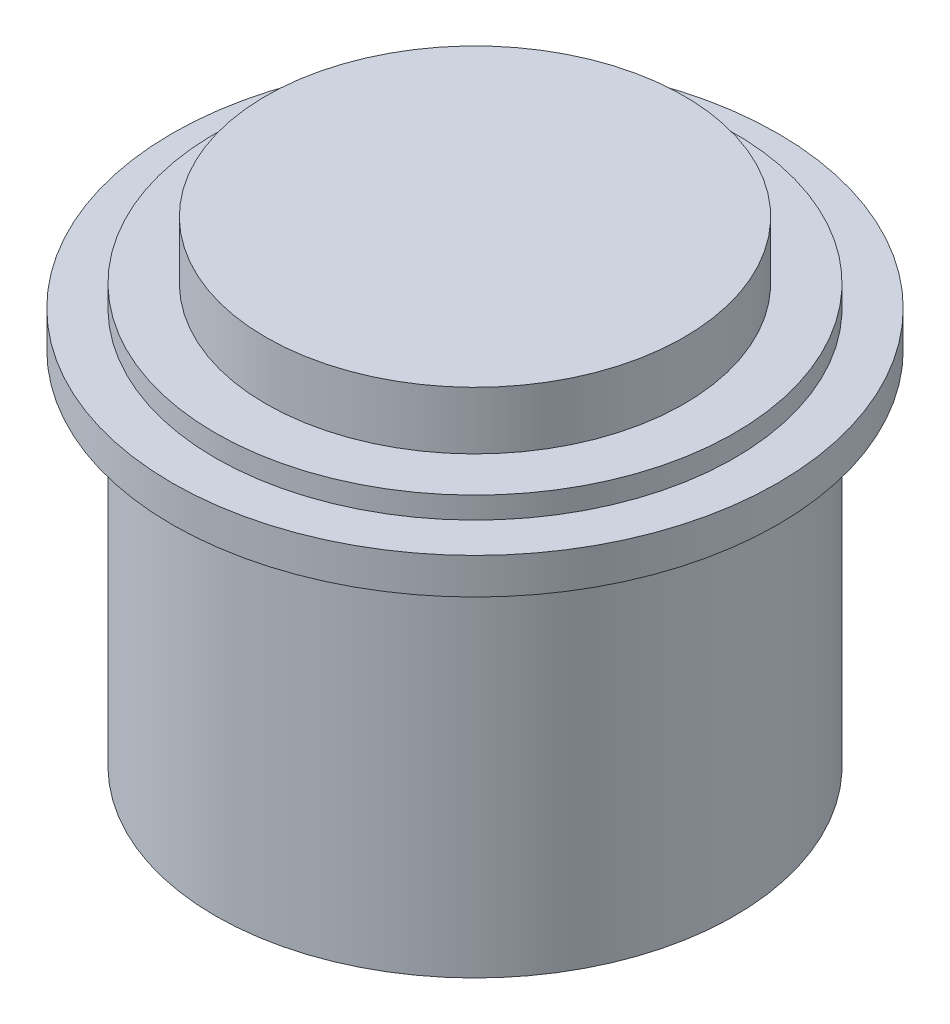
ISO-10303-21;
HEADER;
FILE_DESCRIPTION(('STEP AP214'),'2;1');
FILE_NAME('part.step','',(''),(''),'','','');
FILE_SCHEMA(('AUTOMOTIVE_DESIGN { 1 0 10303 214 1 1 1 1 }'));
ENDSEC;
DATA;
#1=APPLICATION_CONTEXT('core data for automotive mechanical design processes');
#2=APPLICATION_PROTOCOL_DEFINITION('international standard','automotive_design',2000,#1);
#3=PRODUCT_CONTEXT('',#1,'mechanical');
#4=PRODUCT('Part','Part','',(#3));
#5=PRODUCT_RELATED_PRODUCT_CATEGORY('part','',(#4));
#6=PRODUCT_DEFINITION_FORMATION('','',#4);
#7=PRODUCT_DEFINITION_CONTEXT('part definition',#1,'design');
#8=PRODUCT_DEFINITION('design','',#6,#7);
#9=PRODUCT_DEFINITION_SHAPE('','',#8);
#10=(LENGTH_UNIT() NAMED_UNIT(*) SI_UNIT(.MILLI.,.METRE.));
#11=(NAMED_UNIT(*) PLANE_ANGLE_UNIT() SI_UNIT($,.RADIAN.));
#12=(NAMED_UNIT(*) SI_UNIT($,.STERADIAN.) SOLID_ANGLE_UNIT());
#13=UNCERTAINTY_MEASURE_WITH_UNIT(LENGTH_MEASURE(1.E-05),#10,'distance_accuracy_value','');
#14=(GEOMETRIC_REPRESENTATION_CONTEXT(3) GLOBAL_UNCERTAINTY_ASSIGNED_CONTEXT((#13)) GLOBAL_UNIT_ASSIGNED_CONTEXT((#10,
#11,#12)) REPRESENTATION_CONTEXT('',''));
#15=CARTESIAN_POINT('',(0.,0.,0.));
#16=DIRECTION('',(0.,0.,1.));
#17=DIRECTION('',(1.,0.,0.));
#18=AXIS2_PLACEMENT_3D('',#15,#16,#17);
#19=CARTESIAN_POINT('',(-35.4838989717981,66.,6.1271140565352));
#20=DIRECTION('',(0.,-1.,0.));
#21=DIRECTION('',(0.,0.,-1.));
#22=AXIS2_PLACEMENT_3D('',#19,#20,#21);
#23=CYLINDRICAL_SURFACE('',#22,29.);
#24=CARTESIAN_POINT('',(-35.4838989717981,58.,6.1271140565352));
#25=DIRECTION('',(0.,1.,0.));
#26=DIRECTION('',(0.,0.,1.));
#27=AXIS2_PLACEMENT_3D('',#24,#25,#26);
#28=CIRCLE('',#27,29.);
#29=CARTESIAN_POINT('',(-35.4838989717981,58.,35.1271140565352));
#30=VERTEX_POINT('',#29);
#31=EDGE_CURVE('E41',#30,#30,#28,.T.);
#32=ORIENTED_EDGE('',*,*,#31,.T.);
#33=EDGE_LOOP('',(#32));
#34=FACE_BOUND('',#33,.T.);
#35=CARTESIAN_POINT('',(-35.4838989717981,66.,6.1271140565352));
#36=DIRECTION('',(0.,1.,0.));
#37=DIRECTION('',(0.,0.,1.));
#38=AXIS2_PLACEMENT_3D('',#35,#36,#37);
#39=CIRCLE('',#38,29.);
#40=CARTESIAN_POINT('',(-35.4838989717981,66.,35.1271140565352));
#41=VERTEX_POINT('',#40);
#42=EDGE_CURVE('E37',#41,#41,#39,.T.);
#43=ORIENTED_EDGE('',*,*,#42,.F.);
#44=EDGE_LOOP('',(#43));
#45=FACE_BOUND('',#44,.T.);
#46=ADVANCED_FACE('F31',(#34,#45),#23,.T.);
#47=CARTESIAN_POINT('',(0.,66.,0.));
#48=DIRECTION('',(0.,1.,0.));
#49=DIRECTION('',(0.,0.,1.));
#50=AXIS2_PLACEMENT_3D('',#47,#48,#49);
#51=PLANE('',#50);
#52=ORIENTED_EDGE('',*,*,#42,.T.);
#53=EDGE_LOOP('',(#52));
#54=FACE_BOUND('',#53,.T.);
#55=ADVANCED_FACE('F89',(#54),#51,.T.);
#56=CARTESIAN_POINT('',(-35.4838989717981,58.,6.1271140565352));
#57=DIRECTION('',(0.,-1.,0.));
#58=DIRECTION('',(0.,0.,-1.));
#59=AXIS2_PLACEMENT_3D('',#56,#57,#58);
#60=CYLINDRICAL_SURFACE('',#59,36.);
#61=CARTESIAN_POINT('',(-35.4838989717981,55.,6.1271140565352));
#62=DIRECTION('',(0.,1.,0.));
#63=DIRECTION('',(0.,0.,1.));
#64=AXIS2_PLACEMENT_3D('',#61,#62,#63);
#65=CIRCLE('',#64,36.);
#66=CARTESIAN_POINT('',(-35.4838989717981,55.,42.1271140565352));
#67=VERTEX_POINT('',#66);
#68=EDGE_CURVE('E57',#67,#67,#65,.T.);
#69=ORIENTED_EDGE('',*,*,#68,.T.);
#70=EDGE_LOOP('',(#69));
#71=FACE_BOUND('',#70,.T.);
#72=CARTESIAN_POINT('',(-35.4838989717981,58.,6.1271140565352));
#73=DIRECTION('',(0.,1.,0.));
#74=DIRECTION('',(0.,0.,1.));
#75=AXIS2_PLACEMENT_3D('',#72,#73,#74);
#76=CIRCLE('',#75,36.);
#77=CARTESIAN_POINT('',(-35.4838989717981,58.,42.1271140565352));
#78=VERTEX_POINT('',#77);
#79=EDGE_CURVE('E46',#78,#78,#76,.T.);
#80=ORIENTED_EDGE('',*,*,#79,.F.);
#81=EDGE_LOOP('',(#80));
#82=FACE_BOUND('',#81,.T.);
#83=ADVANCED_FACE('F63',(#71,#82),#60,.T.);
#84=CARTESIAN_POINT('',(-35.4838989717981,58.,6.1271140565352));
#85=DIRECTION('',(0.,1.,0.));
#86=DIRECTION('',(0.,0.,1.));
#87=AXIS2_PLACEMENT_3D('',#84,#85,#86);
#88=PLANE('',#87);
#89=ORIENTED_EDGE('',*,*,#31,.F.);
#90=EDGE_LOOP('',(#89));
#91=FACE_BOUND('',#90,.T.);
#92=ORIENTED_EDGE('',*,*,#79,.T.);
#93=EDGE_LOOP('',(#92));
#94=FACE_BOUND('',#93,.T.);
#95=ADVANCED_FACE('F76',(#91,#94),#88,.T.);
#96=CARTESIAN_POINT('',(-35.4838989717981,55.,6.1271140565352));
#97=DIRECTION('',(0.,-1.,0.));
#98=DIRECTION('',(0.,0.,-1.));
#99=AXIS2_PLACEMENT_3D('',#96,#97,#98);
#100=CYLINDRICAL_SURFACE('',#99,42.);
#101=CARTESIAN_POINT('',(-35.4838989717981,55.,6.1271140565352));
#102=DIRECTION('',(0.,1.,0.));
#103=DIRECTION('',(0.,0.,1.));
#104=AXIS2_PLACEMENT_3D('',#101,#102,#103);
#105=CIRCLE('',#104,42.);
#106=CARTESIAN_POINT('',(-35.4838989717981,55.,48.1271140565352));
#107=VERTEX_POINT('',#106);
#108=EDGE_CURVE('E51',#107,#107,#105,.T.);
#109=ORIENTED_EDGE('',*,*,#108,.F.);
#110=EDGE_LOOP('',(#109));
#111=FACE_BOUND('',#110,.T.);
#112=CARTESIAN_POINT('',(-35.4838989717981,50.,6.1271140565352));
#113=DIRECTION('',(0.,1.,0.));
#114=DIRECTION('',(0.,0.,1.));
#115=AXIS2_PLACEMENT_3D('',#112,#113,#114);
#116=CIRCLE('',#115,42.);
#117=CARTESIAN_POINT('',(-35.4838989717981,50.,48.1271140565352));
#118=VERTEX_POINT('',#117);
#119=EDGE_CURVE('E54',#118,#118,#116,.T.);
#120=ORIENTED_EDGE('',*,*,#119,.T.);
#121=EDGE_LOOP('',(#120));
#122=FACE_BOUND('',#121,.T.);
#123=ADVANCED_FACE('F70',(#111,#122),#100,.T.);
#124=CARTESIAN_POINT('',(0.,55.,0.));
#125=DIRECTION('',(0.,1.,0.));
#126=DIRECTION('',(0.,0.,1.));
#127=AXIS2_PLACEMENT_3D('',#124,#125,#126);
#128=PLANE('',#127);
#129=ORIENTED_EDGE('',*,*,#68,.F.);
#130=EDGE_LOOP('',(#129));
#131=FACE_BOUND('',#130,.T.);
#132=ORIENTED_EDGE('',*,*,#108,.T.);
#133=EDGE_LOOP('',(#132));
#134=FACE_BOUND('',#133,.T.);
#135=ADVANCED_FACE('F66',(#131,#134),#128,.T.);
#136=CARTESIAN_POINT('',(0.,50.,0.));
#137=DIRECTION('',(0.,1.,0.));
#138=DIRECTION('',(0.,0.,1.));
#139=AXIS2_PLACEMENT_3D('',#136,#137,#138);
#140=PLANE('',#139);
#141=CARTESIAN_POINT('',(-35.4838989717981,50.,6.1271140565352));
#142=DIRECTION('',(0.,1.,0.));
#143=DIRECTION('',(0.,0.,1.));
#144=AXIS2_PLACEMENT_3D('',#141,#142,#143);
#145=CIRCLE('',#144,36.);
#146=CARTESIAN_POINT('',(-35.4838989717981,50.,42.1271140565352));
#147=VERTEX_POINT('',#146);
#148=EDGE_CURVE('E10',#147,#147,#145,.T.);
#149=ORIENTED_EDGE('',*,*,#148,.T.);
#150=EDGE_LOOP('',(#149));
#151=FACE_BOUND('',#150,.T.);
#152=ORIENTED_EDGE('',*,*,#119,.F.);
#153=EDGE_LOOP('',(#152));
#154=FACE_BOUND('',#153,.T.);
#155=ADVANCED_FACE('F69',(#151,#154),#140,.F.);
#156=CARTESIAN_POINT('',(0.,0.,0.));
#157=DIRECTION('',(0.,1.,0.));
#158=DIRECTION('',(0.,0.,1.));
#159=AXIS2_PLACEMENT_3D('',#156,#157,#158);
#160=PLANE('',#159);
#161=CARTESIAN_POINT('',(-35.4838989717981,0.,6.1271140565352));
#162=DIRECTION('',(0.,1.,0.));
#163=DIRECTION('',(0.,0.,1.));
#164=AXIS2_PLACEMENT_3D('',#161,#162,#163);
#165=CIRCLE('',#164,36.);
#166=CARTESIAN_POINT('',(-35.4838989717981,0.,42.1271140565352));
#167=VERTEX_POINT('',#166);
#168=EDGE_CURVE('E48',#167,#167,#165,.T.);
#169=ORIENTED_EDGE('',*,*,#168,.F.);
#170=EDGE_LOOP('',(#169));
#171=FACE_BOUND('',#170,.T.);
#172=ADVANCED_FACE('F81',(#171),#160,.F.);
#173=ORIENTED_EDGE('',*,*,#168,.T.);
#174=EDGE_LOOP('',(#173));
#175=FACE_BOUND('',#174,.T.);
#176=ORIENTED_EDGE('',*,*,#148,.F.);
#177=EDGE_LOOP('',(#176));
#178=FACE_BOUND('',#177,.T.);
#179=ADVANCED_FACE('F86',(#175,#178),#60,.T.);
#180=CLOSED_SHELL('',(#46,#55,#83,#95,#123,#135,#155,#172,#179));
#181=MANIFOLD_SOLID_BREP('B2',#180);
#182=ADVANCED_BREP_SHAPE_REPRESENTATION('',(#18,#181),#14);
#183=SHAPE_DEFINITION_REPRESENTATION(#9,#182);
ENDSEC;
END-ISO-10303-21;
